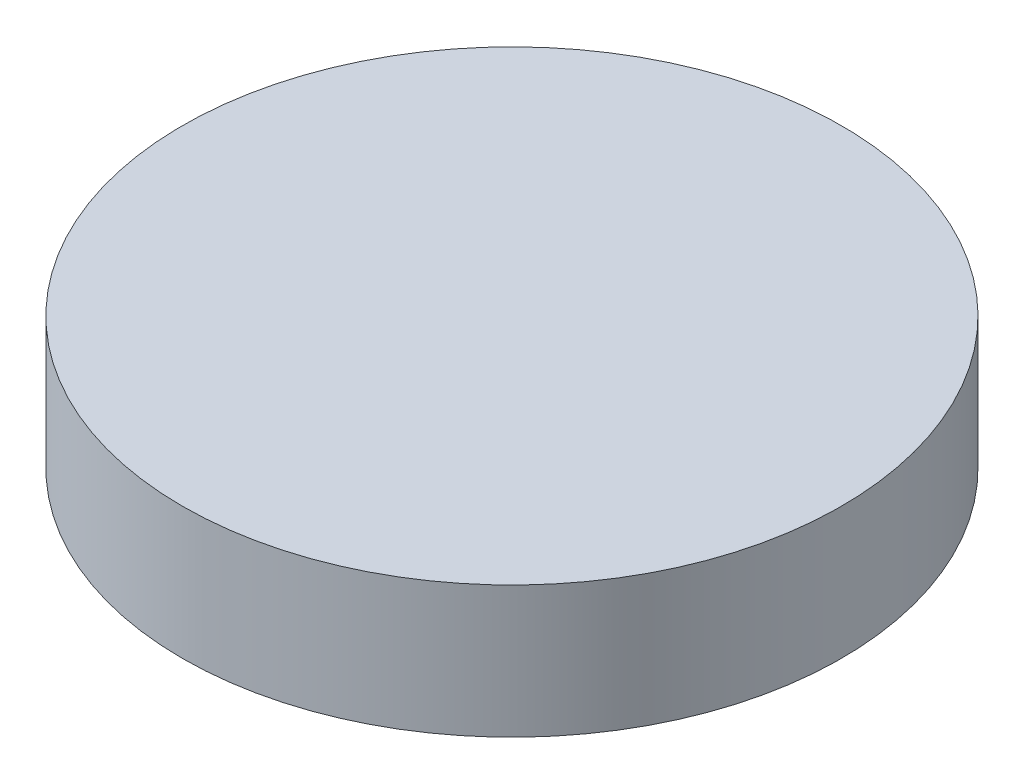
ISO-10303-21;
HEADER;
FILE_DESCRIPTION(('STEP AP214'),'2;1');
FILE_NAME('part.step','',(''),(''),'','','');
FILE_SCHEMA(('AUTOMOTIVE_DESIGN { 1 0 10303 214 1 1 1 1 }'));
ENDSEC;
DATA;
#1=APPLICATION_CONTEXT('core data for automotive mechanical design processes');
#2=APPLICATION_PROTOCOL_DEFINITION('international standard','automotive_design',2000,#1);
#3=PRODUCT_CONTEXT('',#1,'mechanical');
#4=PRODUCT('Part','Part','',(#3));
#5=PRODUCT_RELATED_PRODUCT_CATEGORY('part','',(#4));
#6=PRODUCT_DEFINITION_FORMATION('','',#4);
#7=PRODUCT_DEFINITION_CONTEXT('part definition',#1,'design');
#8=PRODUCT_DEFINITION('design','',#6,#7);
#9=PRODUCT_DEFINITION_SHAPE('','',#8);
#10=(LENGTH_UNIT() NAMED_UNIT(*) SI_UNIT(.MILLI.,.METRE.));
#11=(NAMED_UNIT(*) PLANE_ANGLE_UNIT() SI_UNIT($,.RADIAN.));
#12=(NAMED_UNIT(*) SI_UNIT($,.STERADIAN.) SOLID_ANGLE_UNIT());
#13=UNCERTAINTY_MEASURE_WITH_UNIT(LENGTH_MEASURE(1.E-05),#10,'distance_accuracy_value','');
#14=(GEOMETRIC_REPRESENTATION_CONTEXT(3) GLOBAL_UNCERTAINTY_ASSIGNED_CONTEXT((#13)) GLOBAL_UNIT_ASSIGNED_CONTEXT((#10,
#11,#12)) REPRESENTATION_CONTEXT('',''));
#15=CARTESIAN_POINT('',(0.,0.,0.));
#16=DIRECTION('',(0.,0.,1.));
#17=DIRECTION('',(1.,0.,0.));
#18=AXIS2_PLACEMENT_3D('',#15,#16,#17);
#19=CARTESIAN_POINT('',(0.,1.,0.));
#20=DIRECTION('',(0.,-1.,0.));
#21=DIRECTION('',(0.,0.,-1.));
#22=AXIS2_PLACEMENT_3D('',#19,#20,#21);
#23=CYLINDRICAL_SURFACE('',#22,2.5);
#24=CARTESIAN_POINT('',(0.,1.,0.));
#25=DIRECTION('',(0.,1.,0.));
#26=DIRECTION('',(0.,0.,1.));
#27=AXIS2_PLACEMENT_3D('',#24,#25,#26);
#28=CIRCLE('',#27,2.5);
#29=CARTESIAN_POINT('',(0.,1.,2.5));
#30=VERTEX_POINT('',#29);
#31=EDGE_CURVE('E10',#30,#30,#28,.T.);
#32=ORIENTED_EDGE('',*,*,#31,.F.);
#33=EDGE_LOOP('',(#32));
#34=FACE_BOUND('',#33,.T.);
#35=CARTESIAN_POINT('',(0.,0.,0.));
#36=DIRECTION('',(0.,1.,0.));
#37=DIRECTION('',(0.,0.,1.));
#38=AXIS2_PLACEMENT_3D('',#35,#36,#37);
#39=CIRCLE('',#38,2.5);
#40=CARTESIAN_POINT('',(0.,0.,2.5));
#41=VERTEX_POINT('',#40);
#42=EDGE_CURVE('E35',#41,#41,#39,.T.);
#43=ORIENTED_EDGE('',*,*,#42,.T.);
#44=EDGE_LOOP('',(#43));
#45=FACE_BOUND('',#44,.T.);
#46=ADVANCED_FACE('F32',(#34,#45),#23,.T.);
#47=CARTESIAN_POINT('',(0.,1.,0.));
#48=DIRECTION('',(0.,1.,0.));
#49=DIRECTION('',(0.,0.,1.));
#50=AXIS2_PLACEMENT_3D('',#47,#48,#49);
#51=PLANE('',#50);
#52=ORIENTED_EDGE('',*,*,#31,.T.);
#53=EDGE_LOOP('',(#52));
#54=FACE_BOUND('',#53,.T.);
#55=ADVANCED_FACE('F47',(#54),#51,.T.);
#56=CARTESIAN_POINT('',(0.,0.,0.));
#57=DIRECTION('',(0.,1.,0.));
#58=DIRECTION('',(0.,0.,1.));
#59=AXIS2_PLACEMENT_3D('',#56,#57,#58);
#60=PLANE('',#59);
#61=ORIENTED_EDGE('',*,*,#42,.F.);
#62=EDGE_LOOP('',(#61));
#63=FACE_BOUND('',#62,.T.);
#64=ADVANCED_FACE('F45',(#63),#60,.F.);
#65=CLOSED_SHELL('',(#46,#55,#64));
#66=MANIFOLD_SOLID_BREP('B2',#65);
#67=ADVANCED_BREP_SHAPE_REPRESENTATION('',(#18,#66),#14);
#68=SHAPE_DEFINITION_REPRESENTATION(#9,#67);
ENDSEC;
END-ISO-10303-21;
